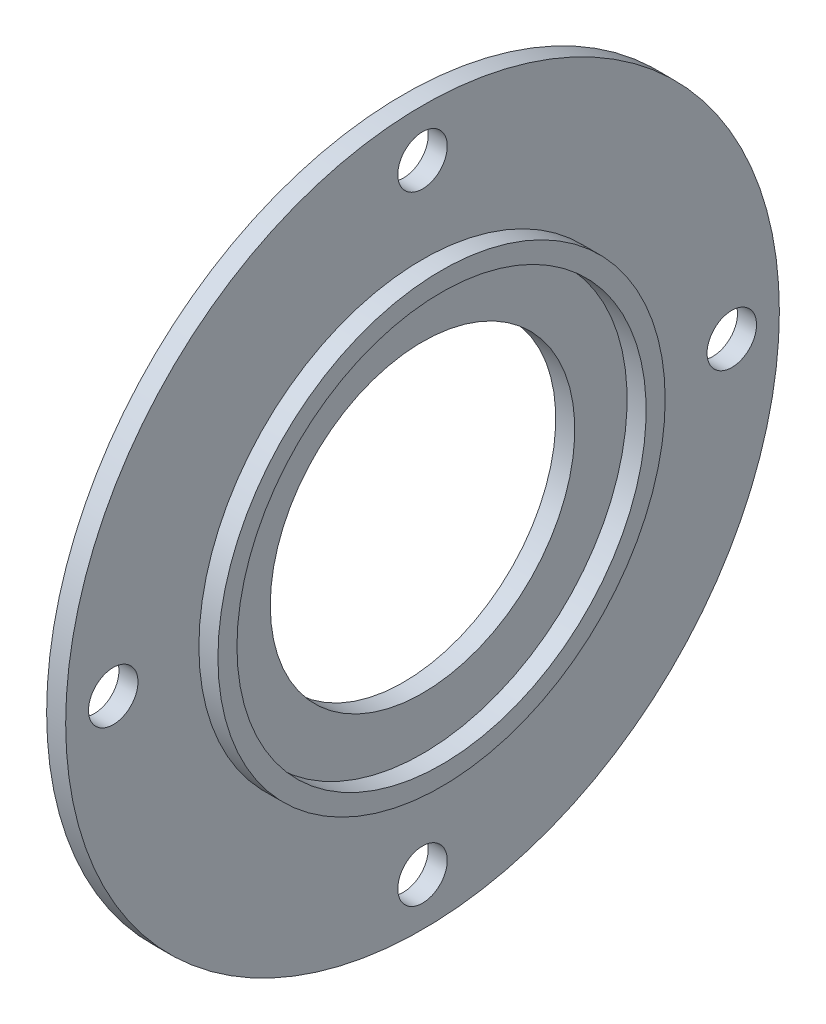
ISO-10303-21;
HEADER;
FILE_DESCRIPTION(('STEP AP214'),'2;1');
FILE_NAME('part.step','',(''),(''),'','','');
FILE_SCHEMA(('AUTOMOTIVE_DESIGN { 1 0 10303 214 1 1 1 1 }'));
ENDSEC;
DATA;
#1=APPLICATION_CONTEXT('core data for automotive mechanical design processes');
#2=APPLICATION_PROTOCOL_DEFINITION('international standard','automotive_design',2000,#1);
#3=PRODUCT_CONTEXT('',#1,'mechanical');
#4=PRODUCT('Part','Part','',(#3));
#5=PRODUCT_RELATED_PRODUCT_CATEGORY('part','',(#4));
#6=PRODUCT_DEFINITION_FORMATION('','',#4);
#7=PRODUCT_DEFINITION_CONTEXT('part definition',#1,'design');
#8=PRODUCT_DEFINITION('design','',#6,#7);
#9=PRODUCT_DEFINITION_SHAPE('','',#8);
#10=(LENGTH_UNIT() NAMED_UNIT(*) SI_UNIT(.MILLI.,.METRE.));
#11=(NAMED_UNIT(*) PLANE_ANGLE_UNIT() SI_UNIT($,.RADIAN.));
#12=(NAMED_UNIT(*) SI_UNIT($,.STERADIAN.) SOLID_ANGLE_UNIT());
#13=UNCERTAINTY_MEASURE_WITH_UNIT(LENGTH_MEASURE(1.E-05),#10,'distance_accuracy_value','');
#14=(GEOMETRIC_REPRESENTATION_CONTEXT(3) GLOBAL_UNCERTAINTY_ASSIGNED_CONTEXT((#13)) GLOBAL_UNIT_ASSIGNED_CONTEXT((#10,
#11,#12)) REPRESENTATION_CONTEXT('',''));
#15=CARTESIAN_POINT('',(0.,0.,0.));
#16=DIRECTION('',(0.,0.,1.));
#17=DIRECTION('',(1.,0.,0.));
#18=AXIS2_PLACEMENT_3D('',#15,#16,#17);
#19=CARTESIAN_POINT('',(0.,37.5,0.));
#20=DIRECTION('',(1.,0.,0.));
#21=DIRECTION('',(0.,0.,-1.));
#22=AXIS2_PLACEMENT_3D('',#19,#20,#21);
#23=PLANE('',#22);
#24=CARTESIAN_POINT('',(0.,3.40419430537206E-13,32.5));
#25=DIRECTION('',(-1.,0.,0.));
#26=DIRECTION('',(0.,0.,1.));
#27=AXIS2_PLACEMENT_3D('',#24,#25,#26);
#28=CIRCLE('',#27,2.6);
#29=CARTESIAN_POINT('',(0.,3.40419430537206E-13,35.1));
#30=VERTEX_POINT('',#29);
#31=EDGE_CURVE('E147',#30,#30,#28,.T.);
#32=ORIENTED_EDGE('',*,*,#31,.F.);
#33=EDGE_LOOP('',(#32));
#34=FACE_BOUND('',#33,.T.);
#35=CARTESIAN_POINT('',(0.,0.,0.));
#36=DIRECTION('',(-1.,0.,0.));
#37=DIRECTION('',(0.,0.,1.));
#38=AXIS2_PLACEMENT_3D('',#35,#36,#37);
#39=CIRCLE('',#38,37.5);
#40=CARTESIAN_POINT('',(0.,0.,37.5));
#41=VERTEX_POINT('',#40);
#42=EDGE_CURVE('E38',#41,#41,#39,.T.);
#43=ORIENTED_EDGE('',*,*,#42,.T.);
#44=EDGE_LOOP('',(#43));
#45=FACE_BOUND('',#44,.T.);
#46=CARTESIAN_POINT('',(0.,0.,0.));
#47=DIRECTION('',(-1.,0.,0.));
#48=DIRECTION('',(0.,0.,1.));
#49=AXIS2_PLACEMENT_3D('',#46,#47,#48);
#50=CIRCLE('',#49,16.);
#51=CARTESIAN_POINT('',(0.,0.,16.));
#52=VERTEX_POINT('',#51);
#53=EDGE_CURVE('E10',#52,#52,#50,.T.);
#54=ORIENTED_EDGE('',*,*,#53,.F.);
#55=EDGE_LOOP('',(#54));
#56=FACE_BOUND('',#55,.T.);
#57=CARTESIAN_POINT('',(0.,32.5,0.));
#58=DIRECTION('',(-1.,0.,0.));
#59=DIRECTION('',(0.,0.,1.));
#60=AXIS2_PLACEMENT_3D('',#57,#58,#59);
#61=CIRCLE('',#60,2.6);
#62=CARTESIAN_POINT('',(0.,32.5,2.6));
#63=VERTEX_POINT('',#62);
#64=EDGE_CURVE('E50',#63,#63,#61,.T.);
#65=ORIENTED_EDGE('',*,*,#64,.F.);
#66=EDGE_LOOP('',(#65));
#67=FACE_BOUND('',#66,.T.);
#68=CARTESIAN_POINT('',(0.,-1.13473143512402E-13,-32.5));
#69=DIRECTION('',(-1.,0.,0.));
#70=DIRECTION('',(0.,0.,1.));
#71=AXIS2_PLACEMENT_3D('',#68,#69,#70);
#72=CIRCLE('',#71,2.6);
#73=CARTESIAN_POINT('',(0.,-1.13473143512402E-13,-29.9));
#74=VERTEX_POINT('',#73);
#75=EDGE_CURVE('E53',#74,#74,#72,.T.);
#76=ORIENTED_EDGE('',*,*,#75,.F.);
#77=EDGE_LOOP('',(#76));
#78=FACE_BOUND('',#77,.T.);
#79=CARTESIAN_POINT('',(0.,-32.5,0.));
#80=DIRECTION('',(-1.,0.,0.));
#81=DIRECTION('',(0.,0.,1.));
#82=AXIS2_PLACEMENT_3D('',#79,#80,#81);
#83=CIRCLE('',#82,2.6);
#84=CARTESIAN_POINT('',(0.,-32.5,2.6));
#85=VERTEX_POINT('',#84);
#86=EDGE_CURVE('E63',#85,#85,#83,.T.);
#87=ORIENTED_EDGE('',*,*,#86,.F.);
#88=EDGE_LOOP('',(#87));
#89=FACE_BOUND('',#88,.T.);
#90=ADVANCED_FACE('F30',(#34,#45,#56,#67,#78,#89),#23,.F.);
#91=CARTESIAN_POINT('',(-7.74338999697788,0.,0.));
#92=DIRECTION('',(-1.,0.,0.));
#93=DIRECTION('',(0.,0.,1.));
#94=AXIS2_PLACEMENT_3D('',#91,#92,#93);
#95=CYLINDRICAL_SURFACE('',#94,16.);
#96=CARTESIAN_POINT('',(2.,0.,0.));
#97=DIRECTION('',(-1.,0.,0.));
#98=DIRECTION('',(0.,0.,1.));
#99=AXIS2_PLACEMENT_3D('',#96,#97,#98);
#100=CIRCLE('',#99,16.);
#101=CARTESIAN_POINT('',(2.,0.,16.));
#102=VERTEX_POINT('',#101);
#103=EDGE_CURVE('E49',#102,#102,#100,.T.);
#104=ORIENTED_EDGE('',*,*,#103,.F.);
#105=EDGE_LOOP('',(#104));
#106=FACE_BOUND('',#105,.T.);
#107=ORIENTED_EDGE('',*,*,#53,.T.);
#108=EDGE_LOOP('',(#107));
#109=FACE_BOUND('',#108,.T.);
#110=ADVANCED_FACE('F32',(#106,#109),#95,.F.);
#111=CARTESIAN_POINT('',(-7.74338999697788,0.,0.));
#112=DIRECTION('',(-1.,0.,0.));
#113=DIRECTION('',(0.,0.,1.));
#114=AXIS2_PLACEMENT_3D('',#111,#112,#113);
#115=CYLINDRICAL_SURFACE('',#114,37.5);
#116=ORIENTED_EDGE('',*,*,#42,.F.);
#117=EDGE_LOOP('',(#116));
#118=FACE_BOUND('',#117,.T.);
#119=CARTESIAN_POINT('',(2.,0.,0.));
#120=DIRECTION('',(-1.,0.,0.));
#121=DIRECTION('',(0.,0.,1.));
#122=AXIS2_PLACEMENT_3D('',#119,#120,#121);
#123=CIRCLE('',#122,37.5);
#124=CARTESIAN_POINT('',(2.,0.,37.5));
#125=VERTEX_POINT('',#124);
#126=EDGE_CURVE('E43',#125,#125,#123,.T.);
#127=ORIENTED_EDGE('',*,*,#126,.T.);
#128=EDGE_LOOP('',(#127));
#129=FACE_BOUND('',#128,.T.);
#130=ADVANCED_FACE('F83',(#118,#129),#115,.T.);
#131=CARTESIAN_POINT('',(2.,23.5,0.));
#132=DIRECTION('',(-1.,0.,0.));
#133=DIRECTION('',(0.,0.,1.));
#134=AXIS2_PLACEMENT_3D('',#131,#132,#133);
#135=PLANE('',#134);
#136=CARTESIAN_POINT('',(2.,3.40419430537206E-13,32.5));
#137=DIRECTION('',(-1.,0.,0.));
#138=DIRECTION('',(0.,0.,1.));
#139=AXIS2_PLACEMENT_3D('',#136,#137,#138);
#140=CIRCLE('',#139,2.6);
#141=CARTESIAN_POINT('',(2.,3.40419430537206E-13,35.1));
#142=VERTEX_POINT('',#141);
#143=EDGE_CURVE('E150',#142,#142,#140,.T.);
#144=ORIENTED_EDGE('',*,*,#143,.T.);
#145=EDGE_LOOP('',(#144));
#146=FACE_BOUND('',#145,.T.);
#147=CARTESIAN_POINT('',(2.,-32.5,0.));
#148=DIRECTION('',(-1.,0.,0.));
#149=DIRECTION('',(0.,0.,1.));
#150=AXIS2_PLACEMENT_3D('',#147,#148,#149);
#151=CIRCLE('',#150,2.6);
#152=CARTESIAN_POINT('',(2.,-32.5,2.6));
#153=VERTEX_POINT('',#152);
#154=EDGE_CURVE('E34',#153,#153,#151,.T.);
#155=ORIENTED_EDGE('',*,*,#154,.T.);
#156=EDGE_LOOP('',(#155));
#157=FACE_BOUND('',#156,.T.);
#158=CARTESIAN_POINT('',(2.,-1.13473143512402E-13,-32.5));
#159=DIRECTION('',(-1.,0.,0.));
#160=DIRECTION('',(0.,0.,1.));
#161=AXIS2_PLACEMENT_3D('',#158,#159,#160);
#162=CIRCLE('',#161,2.6);
#163=CARTESIAN_POINT('',(2.,-1.13473143512402E-13,-29.9));
#164=VERTEX_POINT('',#163);
#165=EDGE_CURVE('E51',#164,#164,#162,.T.);
#166=ORIENTED_EDGE('',*,*,#165,.T.);
#167=EDGE_LOOP('',(#166));
#168=FACE_BOUND('',#167,.T.);
#169=CARTESIAN_POINT('',(2.,32.5,0.));
#170=DIRECTION('',(-1.,0.,0.));
#171=DIRECTION('',(0.,0.,1.));
#172=AXIS2_PLACEMENT_3D('',#169,#170,#171);
#173=CIRCLE('',#172,2.59999999999999);
#174=CARTESIAN_POINT('',(2.,32.5,2.59999999999999));
#175=VERTEX_POINT('',#174);
#176=EDGE_CURVE('E47',#175,#175,#173,.T.);
#177=ORIENTED_EDGE('',*,*,#176,.T.);
#178=EDGE_LOOP('',(#177));
#179=FACE_BOUND('',#178,.T.);
#180=ORIENTED_EDGE('',*,*,#126,.F.);
#181=EDGE_LOOP('',(#180));
#182=FACE_BOUND('',#181,.T.);
#183=CARTESIAN_POINT('',(2.,0.,0.));
#184=DIRECTION('',(-1.,0.,0.));
#185=DIRECTION('',(0.,0.,1.));
#186=AXIS2_PLACEMENT_3D('',#183,#184,#185);
#187=CIRCLE('',#186,23.5);
#188=CARTESIAN_POINT('',(2.,0.,23.5));
#189=VERTEX_POINT('',#188);
#190=EDGE_CURVE('E78',#189,#189,#187,.T.);
#191=ORIENTED_EDGE('',*,*,#190,.T.);
#192=EDGE_LOOP('',(#191));
#193=FACE_BOUND('',#192,.T.);
#194=ADVANCED_FACE('F85',(#146,#157,#168,#179,#182,#193),#135,.F.);
#195=CARTESIAN_POINT('',(-7.74338999697788,0.,0.));
#196=DIRECTION('',(-1.,0.,0.));
#197=DIRECTION('',(0.,0.,1.));
#198=AXIS2_PLACEMENT_3D('',#195,#196,#197);
#199=CYLINDRICAL_SURFACE('',#198,23.5);
#200=ORIENTED_EDGE('',*,*,#190,.F.);
#201=EDGE_LOOP('',(#200));
#202=FACE_BOUND('',#201,.T.);
#203=CARTESIAN_POINT('',(4.,0.,0.));
#204=DIRECTION('',(-1.,0.,0.));
#205=DIRECTION('',(0.,0.,1.));
#206=AXIS2_PLACEMENT_3D('',#203,#204,#205);
#207=CIRCLE('',#206,23.5);
#208=CARTESIAN_POINT('',(4.,0.,23.5));
#209=VERTEX_POINT('',#208);
#210=EDGE_CURVE('E75',#209,#209,#207,.T.);
#211=ORIENTED_EDGE('',*,*,#210,.T.);
#212=EDGE_LOOP('',(#211));
#213=FACE_BOUND('',#212,.T.);
#214=ADVANCED_FACE('F88',(#202,#213),#199,.T.);
#215=CARTESIAN_POINT('',(4.,23.5,0.));
#216=DIRECTION('',(-1.,0.,0.));
#217=DIRECTION('',(0.,0.,1.));
#218=AXIS2_PLACEMENT_3D('',#215,#216,#217);
#219=PLANE('',#218);
#220=ORIENTED_EDGE('',*,*,#210,.F.);
#221=EDGE_LOOP('',(#220));
#222=FACE_BOUND('',#221,.T.);
#223=CARTESIAN_POINT('',(4.,0.,0.));
#224=DIRECTION('',(-1.,0.,0.));
#225=DIRECTION('',(0.,0.,1.));
#226=AXIS2_PLACEMENT_3D('',#223,#224,#225);
#227=CIRCLE('',#226,21.5);
#228=CARTESIAN_POINT('',(4.,0.,21.5));
#229=VERTEX_POINT('',#228);
#230=EDGE_CURVE('E72',#229,#229,#227,.T.);
#231=ORIENTED_EDGE('',*,*,#230,.T.);
#232=EDGE_LOOP('',(#231));
#233=FACE_BOUND('',#232,.T.);
#234=ADVANCED_FACE('F95',(#222,#233),#219,.F.);
#235=CARTESIAN_POINT('',(-7.74338999697788,0.,0.));
#236=DIRECTION('',(-1.,0.,0.));
#237=DIRECTION('',(0.,0.,1.));
#238=AXIS2_PLACEMENT_3D('',#235,#236,#237);
#239=CYLINDRICAL_SURFACE('',#238,21.5);
#240=ORIENTED_EDGE('',*,*,#230,.F.);
#241=EDGE_LOOP('',(#240));
#242=FACE_BOUND('',#241,.T.);
#243=CARTESIAN_POINT('',(2.,0.,0.));
#244=DIRECTION('',(-1.,0.,0.));
#245=DIRECTION('',(0.,0.,1.));
#246=AXIS2_PLACEMENT_3D('',#243,#244,#245);
#247=CIRCLE('',#246,21.5);
#248=CARTESIAN_POINT('',(2.,0.,21.5));
#249=VERTEX_POINT('',#248);
#250=EDGE_CURVE('E69',#249,#249,#247,.T.);
#251=ORIENTED_EDGE('',*,*,#250,.T.);
#252=EDGE_LOOP('',(#251));
#253=FACE_BOUND('',#252,.T.);
#254=ADVANCED_FACE('F101',(#242,#253),#239,.F.);
#255=CARTESIAN_POINT('',(2.,21.5,0.));
#256=DIRECTION('',(-1.,0.,0.));
#257=DIRECTION('',(0.,0.,1.));
#258=AXIS2_PLACEMENT_3D('',#255,#256,#257);
#259=PLANE('',#258);
#260=ORIENTED_EDGE('',*,*,#250,.F.);
#261=EDGE_LOOP('',(#260));
#262=FACE_BOUND('',#261,.T.);
#263=ORIENTED_EDGE('',*,*,#103,.T.);
#264=EDGE_LOOP('',(#263));
#265=FACE_BOUND('',#264,.T.);
#266=ADVANCED_FACE('F107',(#262,#265),#259,.F.);
#267=CARTESIAN_POINT('',(0.,32.5,0.));
#268=DIRECTION('',(-1.,0.,0.));
#269=DIRECTION('',(0.,0.,1.));
#270=AXIS2_PLACEMENT_3D('',#267,#268,#269);
#271=CYLINDRICAL_SURFACE('',#270,2.59999999999999);
#272=ORIENTED_EDGE('',*,*,#64,.T.);
#273=EDGE_LOOP('',(#272));
#274=FACE_BOUND('',#273,.T.);
#275=ORIENTED_EDGE('',*,*,#176,.F.);
#276=EDGE_LOOP('',(#275));
#277=FACE_BOUND('',#276,.T.);
#278=ADVANCED_FACE('F113',(#274,#277),#271,.F.);
#279=CARTESIAN_POINT('',(0.,-1.13473143512402E-13,-32.5));
#280=DIRECTION('',(-1.,0.,0.));
#281=DIRECTION('',(0.,0.,1.));
#282=AXIS2_PLACEMENT_3D('',#279,#280,#281);
#283=CYLINDRICAL_SURFACE('',#282,2.6);
#284=ORIENTED_EDGE('',*,*,#75,.T.);
#285=EDGE_LOOP('',(#284));
#286=FACE_BOUND('',#285,.T.);
#287=ORIENTED_EDGE('',*,*,#165,.F.);
#288=EDGE_LOOP('',(#287));
#289=FACE_BOUND('',#288,.T.);
#290=ADVANCED_FACE('F132',(#286,#289),#283,.F.);
#291=CARTESIAN_POINT('',(0.,-32.5,0.));
#292=DIRECTION('',(-1.,0.,0.));
#293=DIRECTION('',(0.,0.,1.));
#294=AXIS2_PLACEMENT_3D('',#291,#292,#293);
#295=CYLINDRICAL_SURFACE('',#294,2.6);
#296=ORIENTED_EDGE('',*,*,#86,.T.);
#297=EDGE_LOOP('',(#296));
#298=FACE_BOUND('',#297,.T.);
#299=ORIENTED_EDGE('',*,*,#154,.F.);
#300=EDGE_LOOP('',(#299));
#301=FACE_BOUND('',#300,.T.);
#302=ADVANCED_FACE('F136',(#298,#301),#295,.F.);
#303=CARTESIAN_POINT('',(0.,3.40419430537206E-13,32.5));
#304=DIRECTION('',(-1.,0.,0.));
#305=DIRECTION('',(0.,0.,1.));
#306=AXIS2_PLACEMENT_3D('',#303,#304,#305);
#307=CYLINDRICAL_SURFACE('',#306,2.6);
#308=ORIENTED_EDGE('',*,*,#31,.T.);
#309=EDGE_LOOP('',(#308));
#310=FACE_BOUND('',#309,.T.);
#311=ORIENTED_EDGE('',*,*,#143,.F.);
#312=EDGE_LOOP('',(#311));
#313=FACE_BOUND('',#312,.T.);
#314=ADVANCED_FACE('F139',(#310,#313),#307,.F.);
#315=CLOSED_SHELL('',(#90,#110,#130,#194,#214,#234,#254,#266,#278,#290,#302,#314));
#316=MANIFOLD_SOLID_BREP('B2',#315);
#317=ADVANCED_BREP_SHAPE_REPRESENTATION('',(#18,#316),#14);
#318=SHAPE_DEFINITION_REPRESENTATION(#9,#317);
ENDSEC;
END-ISO-10303-21;
